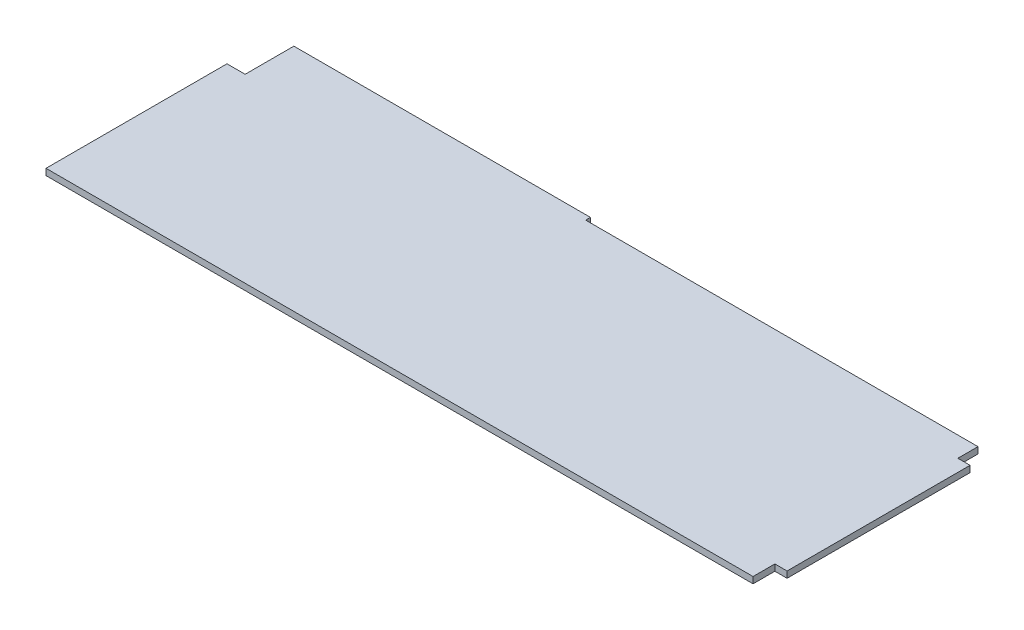
ISO-10303-21;
HEADER;
FILE_DESCRIPTION(('STEP AP214'),'2;1');
FILE_NAME('part.step','',(''),(''),'','','');
FILE_SCHEMA(('AUTOMOTIVE_DESIGN { 1 0 10303 214 1 1 1 1 }'));
ENDSEC;
DATA;
#1=APPLICATION_CONTEXT('core data for automotive mechanical design processes');
#2=APPLICATION_PROTOCOL_DEFINITION('international standard','automotive_design',2000,#1);
#3=PRODUCT_CONTEXT('',#1,'mechanical');
#4=PRODUCT('Part','Part','',(#3));
#5=PRODUCT_RELATED_PRODUCT_CATEGORY('part','',(#4));
#6=PRODUCT_DEFINITION_FORMATION('','',#4);
#7=PRODUCT_DEFINITION_CONTEXT('part definition',#1,'design');
#8=PRODUCT_DEFINITION('design','',#6,#7);
#9=PRODUCT_DEFINITION_SHAPE('','',#8);
#10=(LENGTH_UNIT() NAMED_UNIT(*) SI_UNIT(.MILLI.,.METRE.));
#11=(NAMED_UNIT(*) PLANE_ANGLE_UNIT() SI_UNIT($,.RADIAN.));
#12=(NAMED_UNIT(*) SI_UNIT($,.STERADIAN.) SOLID_ANGLE_UNIT());
#13=UNCERTAINTY_MEASURE_WITH_UNIT(LENGTH_MEASURE(1.E-05),#10,'distance_accuracy_value','');
#14=(GEOMETRIC_REPRESENTATION_CONTEXT(3) GLOBAL_UNCERTAINTY_ASSIGNED_CONTEXT((#13)) GLOBAL_UNIT_ASSIGNED_CONTEXT((#10,
#11,#12)) REPRESENTATION_CONTEXT('',''));
#15=CARTESIAN_POINT('',(0.,0.,0.));
#16=DIRECTION('',(0.,0.,1.));
#17=DIRECTION('',(1.,0.,0.));
#18=AXIS2_PLACEMENT_3D('',#15,#16,#17);
#19=CARTESIAN_POINT('',(296.72,2.67,0.));
#20=DIRECTION('',(0.,0.,-1.));
#21=DIRECTION('',(-1.,0.,0.));
#22=AXIS2_PLACEMENT_3D('',#19,#20,#21);
#23=PLANE('',#22);
#24=DIRECTION('',(1.,0.,0.));
#25=VECTOR('',#24,1.);
#26=CARTESIAN_POINT('',(296.72,0.,0.));
#27=LINE('',#26,#25);
#28=CARTESIAN_POINT('',(0.,0.,0.));
#29=VERTEX_POINT('',#28);
#30=CARTESIAN_POINT('',(296.72,0.,0.));
#31=VERTEX_POINT('',#30);
#32=EDGE_CURVE('E154',#29,#31,#27,.T.);
#33=ORIENTED_EDGE('',*,*,#32,.T.);
#34=DIRECTION('',(0.,-1.,0.));
#35=VECTOR('',#34,1.);
#36=CARTESIAN_POINT('',(296.72,2.67,0.));
#37=LINE('',#36,#35);
#38=CARTESIAN_POINT('',(296.72,2.67,0.));
#39=VERTEX_POINT('',#38);
#40=EDGE_CURVE('E11',#39,#31,#37,.T.);
#41=ORIENTED_EDGE('',*,*,#40,.F.);
#42=DIRECTION('',(1.,0.,0.));
#43=VECTOR('',#42,1.);
#44=CARTESIAN_POINT('',(296.72,2.67,0.));
#45=LINE('',#44,#43);
#46=CARTESIAN_POINT('',(0.,2.67,0.));
#47=VERTEX_POINT('',#46);
#48=EDGE_CURVE('E176',#47,#39,#45,.T.);
#49=ORIENTED_EDGE('',*,*,#48,.F.);
#50=DIRECTION('',(0.,-1.,0.));
#51=VECTOR('',#50,1.);
#52=CARTESIAN_POINT('',(0.,2.67,0.));
#53=LINE('',#52,#51);
#54=EDGE_CURVE('E150',#47,#29,#53,.T.);
#55=ORIENTED_EDGE('',*,*,#54,.T.);
#56=EDGE_LOOP('',(#33,#41,#49,#55));
#57=FACE_BOUND('',#56,.T.);
#58=ADVANCED_FACE('F34',(#57),#23,.F.);
#59=CARTESIAN_POINT('',(296.72,2.67,0.));
#60=DIRECTION('',(-1.,0.,0.));
#61=DIRECTION('',(0.,0.,1.));
#62=AXIS2_PLACEMENT_3D('',#59,#60,#61);
#63=PLANE('',#62);
#64=DIRECTION('',(0.,0.,-1.));
#65=VECTOR('',#64,1.);
#66=CARTESIAN_POINT('',(296.72,0.,0.));
#67=LINE('',#66,#65);
#68=CARTESIAN_POINT('',(296.72,0.,-9.15000000000001));
#69=VERTEX_POINT('',#68);
#70=EDGE_CURVE('E157',#31,#69,#67,.T.);
#71=ORIENTED_EDGE('',*,*,#70,.T.);
#72=DIRECTION('',(0.,-1.,0.));
#73=VECTOR('',#72,1.);
#74=CARTESIAN_POINT('',(296.72,2.67,-9.15000000000001));
#75=LINE('',#74,#73);
#76=CARTESIAN_POINT('',(296.72,2.67,-9.15000000000001));
#77=VERTEX_POINT('',#76);
#78=EDGE_CURVE('E42',#77,#69,#75,.T.);
#79=ORIENTED_EDGE('',*,*,#78,.F.);
#80=DIRECTION('',(0.,0.,-1.));
#81=VECTOR('',#80,1.);
#82=CARTESIAN_POINT('',(296.72,2.67,0.));
#83=LINE('',#82,#81);
#84=EDGE_CURVE('E105',#39,#77,#83,.T.);
#85=ORIENTED_EDGE('',*,*,#84,.F.);
#86=ORIENTED_EDGE('',*,*,#40,.T.);
#87=EDGE_LOOP('',(#71,#79,#85,#86));
#88=FACE_BOUND('',#87,.T.);
#89=ADVANCED_FACE('F254',(#88),#63,.F.);
#90=CARTESIAN_POINT('',(296.72,2.67,-9.15000000000001));
#91=DIRECTION('',(0.,0.,-1.));
#92=DIRECTION('',(-1.,0.,0.));
#93=AXIS2_PLACEMENT_3D('',#90,#91,#92);
#94=PLANE('',#93);
#95=DIRECTION('',(1.,0.,0.));
#96=VECTOR('',#95,1.);
#97=CARTESIAN_POINT('',(296.72,0.,-9.15000000000001));
#98=LINE('',#97,#96);
#99=CARTESIAN_POINT('',(301.84,0.,-9.15));
#100=VERTEX_POINT('',#99);
#101=EDGE_CURVE('E159',#69,#100,#98,.T.);
#102=ORIENTED_EDGE('',*,*,#101,.T.);
#103=DIRECTION('',(0.,-1.,0.));
#104=VECTOR('',#103,1.);
#105=CARTESIAN_POINT('',(301.84,2.67,-9.15));
#106=LINE('',#105,#104);
#107=CARTESIAN_POINT('',(301.84,2.67,-9.15));
#108=VERTEX_POINT('',#107);
#109=EDGE_CURVE('E195',#108,#100,#106,.T.);
#110=ORIENTED_EDGE('',*,*,#109,.F.);
#111=DIRECTION('',(1.,0.,0.));
#112=VECTOR('',#111,1.);
#113=CARTESIAN_POINT('',(296.72,2.67,-9.15000000000001));
#114=LINE('',#113,#112);
#115=EDGE_CURVE('E203',#77,#108,#114,.T.);
#116=ORIENTED_EDGE('',*,*,#115,.F.);
#117=ORIENTED_EDGE('',*,*,#78,.T.);
#118=EDGE_LOOP('',(#102,#110,#116,#117));
#119=FACE_BOUND('',#118,.T.);
#120=ADVANCED_FACE('F201',(#119),#94,.F.);
#121=CARTESIAN_POINT('',(301.84,2.67,-9.15));
#122=DIRECTION('',(-1.,0.,0.));
#123=DIRECTION('',(0.,0.,1.));
#124=AXIS2_PLACEMENT_3D('',#121,#122,#123);
#125=PLANE('',#124);
#126=DIRECTION('',(0.,0.,-1.));
#127=VECTOR('',#126,1.);
#128=CARTESIAN_POINT('',(301.84,0.,-9.15));
#129=LINE('',#128,#127);
#130=CARTESIAN_POINT('',(301.84,0.,-85.95));
#131=VERTEX_POINT('',#130);
#132=EDGE_CURVE('E161',#100,#131,#129,.T.);
#133=ORIENTED_EDGE('',*,*,#132,.T.);
#134=DIRECTION('',(0.,-1.,0.));
#135=VECTOR('',#134,1.);
#136=CARTESIAN_POINT('',(301.84,2.67,-85.95));
#137=LINE('',#136,#135);
#138=CARTESIAN_POINT('',(301.84,2.67,-85.95));
#139=VERTEX_POINT('',#138);
#140=EDGE_CURVE('E192',#139,#131,#137,.T.);
#141=ORIENTED_EDGE('',*,*,#140,.F.);
#142=DIRECTION('',(0.,0.,-1.));
#143=VECTOR('',#142,1.);
#144=CARTESIAN_POINT('',(301.84,2.67,-9.15));
#145=LINE('',#144,#143);
#146=EDGE_CURVE('E221',#108,#139,#145,.T.);
#147=ORIENTED_EDGE('',*,*,#146,.F.);
#148=ORIENTED_EDGE('',*,*,#109,.T.);
#149=EDGE_LOOP('',(#133,#141,#147,#148));
#150=FACE_BOUND('',#149,.T.);
#151=ADVANCED_FACE('F212',(#150),#125,.F.);
#152=CARTESIAN_POINT('',(301.84,2.67,-85.95));
#153=DIRECTION('',(0.,0.,1.));
#154=DIRECTION('',(1.,0.,0.));
#155=AXIS2_PLACEMENT_3D('',#152,#153,#154);
#156=PLANE('',#155);
#157=DIRECTION('',(-1.,0.,0.));
#158=VECTOR('',#157,1.);
#159=CARTESIAN_POINT('',(301.84,0.,-85.95));
#160=LINE('',#159,#158);
#161=CARTESIAN_POINT('',(296.72,0.,-85.95));
#162=VERTEX_POINT('',#161);
#163=EDGE_CURVE('E163',#131,#162,#160,.T.);
#164=ORIENTED_EDGE('',*,*,#163,.T.);
#165=DIRECTION('',(0.,-1.,0.));
#166=VECTOR('',#165,1.);
#167=CARTESIAN_POINT('',(296.72,2.67,-85.95));
#168=LINE('',#167,#166);
#169=CARTESIAN_POINT('',(296.72,2.67,-85.95));
#170=VERTEX_POINT('',#169);
#171=EDGE_CURVE('E189',#170,#162,#168,.T.);
#172=ORIENTED_EDGE('',*,*,#171,.F.);
#173=DIRECTION('',(-1.,0.,0.));
#174=VECTOR('',#173,1.);
#175=CARTESIAN_POINT('',(301.84,2.67,-85.95));
#176=LINE('',#175,#174);
#177=EDGE_CURVE('E218',#139,#170,#176,.T.);
#178=ORIENTED_EDGE('',*,*,#177,.F.);
#179=ORIENTED_EDGE('',*,*,#140,.T.);
#180=EDGE_LOOP('',(#164,#172,#178,#179));
#181=FACE_BOUND('',#180,.T.);
#182=ADVANCED_FACE('F216',(#181),#156,.F.);
#183=CARTESIAN_POINT('',(296.72,2.67,-85.95));
#184=DIRECTION('',(-1.,0.,0.));
#185=DIRECTION('',(0.,0.,1.));
#186=AXIS2_PLACEMENT_3D('',#183,#184,#185);
#187=PLANE('',#186);
#188=DIRECTION('',(0.,0.,-1.));
#189=VECTOR('',#188,1.);
#190=CARTESIAN_POINT('',(296.72,0.,-85.95));
#191=LINE('',#190,#189);
#192=CARTESIAN_POINT('',(296.72,0.,-94.4));
#193=VERTEX_POINT('',#192);
#194=EDGE_CURVE('E165',#162,#193,#191,.T.);
#195=ORIENTED_EDGE('',*,*,#194,.T.);
#196=DIRECTION('',(0.,-1.,0.));
#197=VECTOR('',#196,1.);
#198=CARTESIAN_POINT('',(296.72,2.67,-94.4));
#199=LINE('',#198,#197);
#200=CARTESIAN_POINT('',(296.72,2.67,-94.4));
#201=VERTEX_POINT('',#200);
#202=EDGE_CURVE('E186',#201,#193,#199,.T.);
#203=ORIENTED_EDGE('',*,*,#202,.F.);
#204=DIRECTION('',(0.,0.,-1.));
#205=VECTOR('',#204,1.);
#206=CARTESIAN_POINT('',(296.72,2.67,-85.95));
#207=LINE('',#206,#205);
#208=EDGE_CURVE('E220',#170,#201,#207,.T.);
#209=ORIENTED_EDGE('',*,*,#208,.F.);
#210=ORIENTED_EDGE('',*,*,#171,.T.);
#211=EDGE_LOOP('',(#195,#203,#209,#210));
#212=FACE_BOUND('',#211,.T.);
#213=ADVANCED_FACE('F267',(#212),#187,.F.);
#214=CARTESIAN_POINT('',(132.07,2.67,-94.4));
#215=DIRECTION('',(0.,0.,1.));
#216=DIRECTION('',(1.,0.,0.));
#217=AXIS2_PLACEMENT_3D('',#214,#215,#216);
#218=PLANE('',#217);
#219=DIRECTION('',(-1.,0.,0.));
#220=VECTOR('',#219,1.);
#221=CARTESIAN_POINT('',(132.07,0.,-94.4));
#222=LINE('',#221,#220);
#223=CARTESIAN_POINT('',(132.07,0.,-94.4));
#224=VERTEX_POINT('',#223);
#225=EDGE_CURVE('E167',#193,#224,#222,.T.);
#226=ORIENTED_EDGE('',*,*,#225,.T.);
#227=DIRECTION('',(0.,-1.,0.));
#228=VECTOR('',#227,1.);
#229=CARTESIAN_POINT('',(132.07,2.67,-94.4));
#230=LINE('',#229,#228);
#231=CARTESIAN_POINT('',(132.07,2.67,-94.4));
#232=VERTEX_POINT('',#231);
#233=EDGE_CURVE('E183',#232,#224,#230,.T.);
#234=ORIENTED_EDGE('',*,*,#233,.F.);
#235=DIRECTION('',(-1.,0.,0.));
#236=VECTOR('',#235,1.);
#237=CARTESIAN_POINT('',(132.07,2.67,-94.4));
#238=LINE('',#237,#236);
#239=EDGE_CURVE('E223',#201,#232,#238,.T.);
#240=ORIENTED_EDGE('',*,*,#239,.F.);
#241=ORIENTED_EDGE('',*,*,#202,.T.);
#242=EDGE_LOOP('',(#226,#234,#240,#241));
#243=FACE_BOUND('',#242,.T.);
#244=ADVANCED_FACE('F270',(#243),#218,.F.);
#245=CARTESIAN_POINT('',(132.07,2.67,-96.4));
#246=DIRECTION('',(-1.,0.,0.));
#247=DIRECTION('',(0.,0.,1.));
#248=AXIS2_PLACEMENT_3D('',#245,#246,#247);
#249=PLANE('',#248);
#250=DIRECTION('',(0.,0.,-1.));
#251=VECTOR('',#250,1.);
#252=CARTESIAN_POINT('',(132.07,0.,-96.4));
#253=LINE('',#252,#251);
#254=CARTESIAN_POINT('',(132.07,0.,-96.4));
#255=VERTEX_POINT('',#254);
#256=EDGE_CURVE('E169',#224,#255,#253,.T.);
#257=ORIENTED_EDGE('',*,*,#256,.T.);
#258=DIRECTION('',(0.,-1.,0.));
#259=VECTOR('',#258,1.);
#260=CARTESIAN_POINT('',(132.07,2.67,-96.4));
#261=LINE('',#260,#259);
#262=CARTESIAN_POINT('',(132.07,2.67,-96.4));
#263=VERTEX_POINT('',#262);
#264=EDGE_CURVE('E180',#263,#255,#261,.T.);
#265=ORIENTED_EDGE('',*,*,#264,.F.);
#266=DIRECTION('',(0.,0.,-1.));
#267=VECTOR('',#266,1.);
#268=CARTESIAN_POINT('',(132.07,2.67,-96.4));
#269=LINE('',#268,#267);
#270=EDGE_CURVE('E229',#232,#263,#269,.T.);
#271=ORIENTED_EDGE('',*,*,#270,.F.);
#272=ORIENTED_EDGE('',*,*,#233,.T.);
#273=EDGE_LOOP('',(#257,#265,#271,#272));
#274=FACE_BOUND('',#273,.T.);
#275=ADVANCED_FACE('F235',(#274),#249,.F.);
#276=CARTESIAN_POINT('',(7.62,2.67,-96.4));
#277=DIRECTION('',(0.,0.,1.));
#278=DIRECTION('',(1.,0.,0.));
#279=AXIS2_PLACEMENT_3D('',#276,#277,#278);
#280=PLANE('',#279);
#281=DIRECTION('',(-1.,0.,0.));
#282=VECTOR('',#281,1.);
#283=CARTESIAN_POINT('',(7.62,0.,-96.4));
#284=LINE('',#283,#282);
#285=CARTESIAN_POINT('',(7.62,0.,-96.4));
#286=VERTEX_POINT('',#285);
#287=EDGE_CURVE('E171',#255,#286,#284,.T.);
#288=ORIENTED_EDGE('',*,*,#287,.T.);
#289=DIRECTION('',(0.,-1.,0.));
#290=VECTOR('',#289,1.);
#291=CARTESIAN_POINT('',(7.62,2.67,-96.4));
#292=LINE('',#291,#290);
#293=CARTESIAN_POINT('',(7.62,2.67,-96.4));
#294=VERTEX_POINT('',#293);
#295=EDGE_CURVE('E145',#294,#286,#292,.T.);
#296=ORIENTED_EDGE('',*,*,#295,.F.);
#297=DIRECTION('',(-1.,0.,0.));
#298=VECTOR('',#297,1.);
#299=CARTESIAN_POINT('',(7.62,2.67,-96.4));
#300=LINE('',#299,#298);
#301=EDGE_CURVE('E136',#263,#294,#300,.T.);
#302=ORIENTED_EDGE('',*,*,#301,.F.);
#303=ORIENTED_EDGE('',*,*,#264,.T.);
#304=EDGE_LOOP('',(#288,#296,#302,#303));
#305=FACE_BOUND('',#304,.T.);
#306=ADVANCED_FACE('F239',(#305),#280,.F.);
#307=CARTESIAN_POINT('',(7.62,2.67,-75.95));
#308=DIRECTION('',(1.,0.,0.));
#309=DIRECTION('',(0.,0.,-1.));
#310=AXIS2_PLACEMENT_3D('',#307,#308,#309);
#311=PLANE('',#310);
#312=DIRECTION('',(0.,0.,1.));
#313=VECTOR('',#312,1.);
#314=CARTESIAN_POINT('',(7.62,0.,-75.95));
#315=LINE('',#314,#313);
#316=CARTESIAN_POINT('',(7.62,0.,-75.95));
#317=VERTEX_POINT('',#316);
#318=EDGE_CURVE('E144',#286,#317,#315,.T.);
#319=ORIENTED_EDGE('',*,*,#318,.T.);
#320=DIRECTION('',(0.,-1.,0.));
#321=VECTOR('',#320,1.);
#322=CARTESIAN_POINT('',(7.62,2.67,-75.95));
#323=LINE('',#322,#321);
#324=CARTESIAN_POINT('',(7.62,2.67,-75.95));
#325=VERTEX_POINT('',#324);
#326=EDGE_CURVE('E141',#325,#317,#323,.T.);
#327=ORIENTED_EDGE('',*,*,#326,.F.);
#328=DIRECTION('',(0.,0.,1.));
#329=VECTOR('',#328,1.);
#330=CARTESIAN_POINT('',(7.62,2.67,-75.95));
#331=LINE('',#330,#329);
#332=EDGE_CURVE('E130',#294,#325,#331,.T.);
#333=ORIENTED_EDGE('',*,*,#332,.F.);
#334=ORIENTED_EDGE('',*,*,#295,.T.);
#335=EDGE_LOOP('',(#319,#327,#333,#334));
#336=FACE_BOUND('',#335,.T.);
#337=ADVANCED_FACE('F142',(#336),#311,.F.);
#338=CARTESIAN_POINT('',(0.,2.67,-75.95));
#339=DIRECTION('',(0.,0.,1.));
#340=DIRECTION('',(1.,0.,0.));
#341=AXIS2_PLACEMENT_3D('',#338,#339,#340);
#342=PLANE('',#341);
#343=DIRECTION('',(-1.,0.,0.));
#344=VECTOR('',#343,1.);
#345=CARTESIAN_POINT('',(0.,0.,-75.95));
#346=LINE('',#345,#344);
#347=CARTESIAN_POINT('',(0.,0.,-75.95));
#348=VERTEX_POINT('',#347);
#349=EDGE_CURVE('E91',#317,#348,#346,.T.);
#350=ORIENTED_EDGE('',*,*,#349,.T.);
#351=DIRECTION('',(0.,-1.,0.));
#352=VECTOR('',#351,1.);
#353=CARTESIAN_POINT('',(0.,2.67,-75.95));
#354=LINE('',#353,#352);
#355=CARTESIAN_POINT('',(0.,2.67,-75.95));
#356=VERTEX_POINT('',#355);
#357=EDGE_CURVE('E146',#356,#348,#354,.T.);
#358=ORIENTED_EDGE('',*,*,#357,.F.);
#359=DIRECTION('',(-1.,0.,0.));
#360=VECTOR('',#359,1.);
#361=CARTESIAN_POINT('',(0.,2.67,-75.95));
#362=LINE('',#361,#360);
#363=EDGE_CURVE('E134',#325,#356,#362,.T.);
#364=ORIENTED_EDGE('',*,*,#363,.F.);
#365=ORIENTED_EDGE('',*,*,#326,.T.);
#366=EDGE_LOOP('',(#350,#358,#364,#365));
#367=FACE_BOUND('',#366,.T.);
#368=ADVANCED_FACE('F148',(#367),#342,.F.);
#369=CARTESIAN_POINT('',(0.,2.67,0.));
#370=DIRECTION('',(1.,0.,0.));
#371=DIRECTION('',(0.,0.,-1.));
#372=AXIS2_PLACEMENT_3D('',#369,#370,#371);
#373=PLANE('',#372);
#374=DIRECTION('',(0.,0.,1.));
#375=VECTOR('',#374,1.);
#376=CARTESIAN_POINT('',(0.,0.,0.));
#377=LINE('',#376,#375);
#378=EDGE_CURVE('E97',#348,#29,#377,.T.);
#379=ORIENTED_EDGE('',*,*,#378,.T.);
#380=ORIENTED_EDGE('',*,*,#54,.F.);
#381=DIRECTION('',(0.,0.,1.));
#382=VECTOR('',#381,1.);
#383=CARTESIAN_POINT('',(0.,2.67,0.));
#384=LINE('',#383,#382);
#385=EDGE_CURVE('E50',#356,#47,#384,.T.);
#386=ORIENTED_EDGE('',*,*,#385,.F.);
#387=ORIENTED_EDGE('',*,*,#357,.T.);
#388=EDGE_LOOP('',(#379,#380,#386,#387));
#389=FACE_BOUND('',#388,.T.);
#390=ADVANCED_FACE('F243',(#389),#373,.F.);
#391=CARTESIAN_POINT('',(0.,2.67,0.));
#392=DIRECTION('',(0.,-1.,0.));
#393=DIRECTION('',(0.,0.,-1.));
#394=AXIS2_PLACEMENT_3D('',#391,#392,#393);
#395=PLANE('',#394);
#396=ORIENTED_EDGE('',*,*,#48,.T.);
#397=ORIENTED_EDGE('',*,*,#84,.T.);
#398=ORIENTED_EDGE('',*,*,#115,.T.);
#399=ORIENTED_EDGE('',*,*,#146,.T.);
#400=ORIENTED_EDGE('',*,*,#177,.T.);
#401=ORIENTED_EDGE('',*,*,#208,.T.);
#402=ORIENTED_EDGE('',*,*,#239,.T.);
#403=ORIENTED_EDGE('',*,*,#270,.T.);
#404=ORIENTED_EDGE('',*,*,#301,.T.);
#405=ORIENTED_EDGE('',*,*,#332,.T.);
#406=ORIENTED_EDGE('',*,*,#363,.T.);
#407=ORIENTED_EDGE('',*,*,#385,.T.);
#408=EDGE_LOOP('',(#396,#397,#398,#399,#400,#401,#402,#403,#404,#405,#406,#407));
#409=FACE_BOUND('',#408,.T.);
#410=ADVANCED_FACE('F132',(#409),#395,.F.);
#411=CARTESIAN_POINT('',(0.,0.,0.));
#412=DIRECTION('',(0.,-1.,0.));
#413=DIRECTION('',(0.,0.,-1.));
#414=AXIS2_PLACEMENT_3D('',#411,#412,#413);
#415=PLANE('',#414);
#416=ORIENTED_EDGE('',*,*,#32,.F.);
#417=ORIENTED_EDGE('',*,*,#378,.F.);
#418=ORIENTED_EDGE('',*,*,#349,.F.);
#419=ORIENTED_EDGE('',*,*,#318,.F.);
#420=ORIENTED_EDGE('',*,*,#287,.F.);
#421=ORIENTED_EDGE('',*,*,#256,.F.);
#422=ORIENTED_EDGE('',*,*,#225,.F.);
#423=ORIENTED_EDGE('',*,*,#194,.F.);
#424=ORIENTED_EDGE('',*,*,#163,.F.);
#425=ORIENTED_EDGE('',*,*,#132,.F.);
#426=ORIENTED_EDGE('',*,*,#101,.F.);
#427=ORIENTED_EDGE('',*,*,#70,.F.);
#428=EDGE_LOOP('',(#416,#417,#418,#419,#420,#421,#422,#423,#424,#425,#426,#427));
#429=FACE_BOUND('',#428,.T.);
#430=ADVANCED_FACE('F207',(#429),#415,.T.);
#431=CLOSED_SHELL('',(#58,#89,#120,#151,#182,#213,#244,#275,#306,#337,#368,#390,#410,#430));
#432=MANIFOLD_SOLID_BREP('B2',#431);
#433=ADVANCED_BREP_SHAPE_REPRESENTATION('',(#18,#432),#14);
#434=SHAPE_DEFINITION_REPRESENTATION(#9,#433);
ENDSEC;
END-ISO-10303-21;
